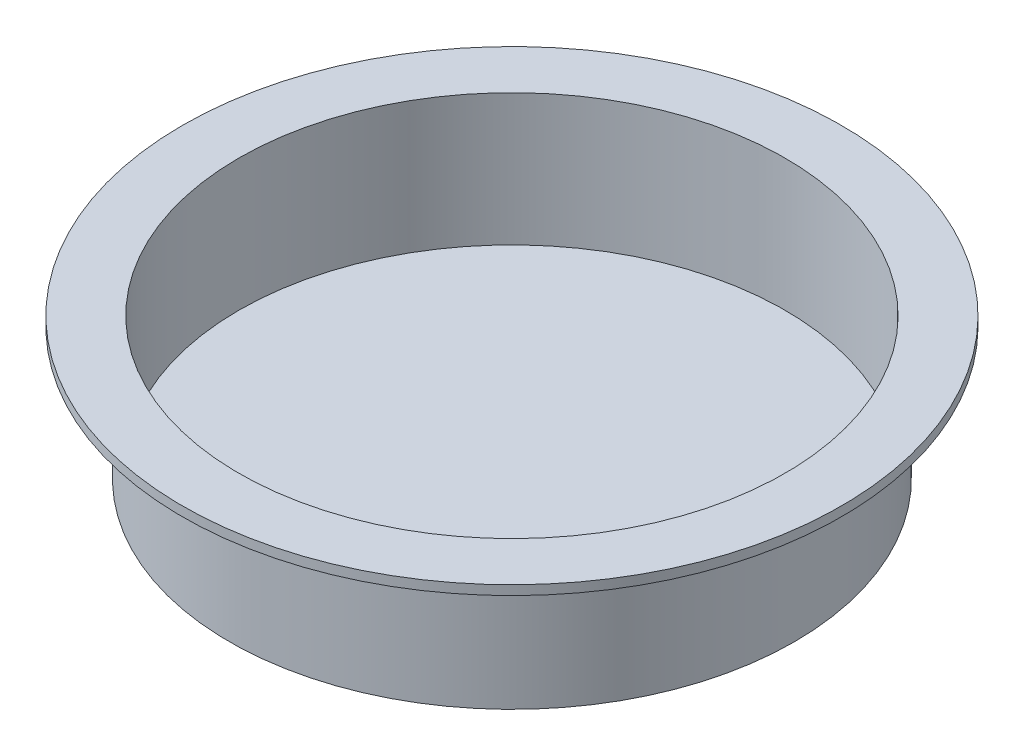
ISO-10303-21;
HEADER;
FILE_DESCRIPTION(('STEP AP214'),'2;1');
FILE_NAME('part.step','',(''),(''),'','','');
FILE_SCHEMA(('AUTOMOTIVE_DESIGN { 1 0 10303 214 1 1 1 1 }'));
ENDSEC;
DATA;
#1=APPLICATION_CONTEXT('core data for automotive mechanical design processes');
#2=APPLICATION_PROTOCOL_DEFINITION('international standard','automotive_design',2000,#1);
#3=PRODUCT_CONTEXT('',#1,'mechanical');
#4=PRODUCT('Part','Part','',(#3));
#5=PRODUCT_RELATED_PRODUCT_CATEGORY('part','',(#4));
#6=PRODUCT_DEFINITION_FORMATION('','',#4);
#7=PRODUCT_DEFINITION_CONTEXT('part definition',#1,'design');
#8=PRODUCT_DEFINITION('design','',#6,#7);
#9=PRODUCT_DEFINITION_SHAPE('','',#8);
#10=(LENGTH_UNIT() NAMED_UNIT(*) SI_UNIT(.MILLI.,.METRE.));
#11=(NAMED_UNIT(*) PLANE_ANGLE_UNIT() SI_UNIT($,.RADIAN.));
#12=(NAMED_UNIT(*) SI_UNIT($,.STERADIAN.) SOLID_ANGLE_UNIT());
#13=UNCERTAINTY_MEASURE_WITH_UNIT(LENGTH_MEASURE(1.E-05),#10,'distance_accuracy_value','');
#14=(GEOMETRIC_REPRESENTATION_CONTEXT(3) GLOBAL_UNCERTAINTY_ASSIGNED_CONTEXT((#13)) GLOBAL_UNIT_ASSIGNED_CONTEXT((#10,
#11,#12)) REPRESENTATION_CONTEXT('',''));
#15=CARTESIAN_POINT('',(0.,0.,0.));
#16=DIRECTION('',(0.,0.,1.));
#17=DIRECTION('',(1.,0.,0.));
#18=AXIS2_PLACEMENT_3D('',#15,#16,#17);
#19=CARTESIAN_POINT('',(0.,0.,0.));
#20=DIRECTION('',(0.,1.,0.));
#21=DIRECTION('',(-1.,0.,0.));
#22=AXIS2_PLACEMENT_3D('',#19,#20,#21);
#23=PLANE('',#22);
#24=CARTESIAN_POINT('',(0.,0.,0.));
#25=DIRECTION('',(0.,1.,0.));
#26=DIRECTION('',(-1.,0.,0.));
#27=AXIS2_PLACEMENT_3D('',#24,#25,#26);
#28=CIRCLE('',#27,38.1);
#29=CARTESIAN_POINT('',(-38.1,0.,0.));
#30=VERTEX_POINT('',#29);
#31=EDGE_CURVE('E10',#30,#30,#28,.T.);
#32=ORIENTED_EDGE('',*,*,#31,.F.);
#33=EDGE_LOOP('',(#32));
#34=FACE_BOUND('',#33,.T.);
#35=ADVANCED_FACE('F31',(#34),#23,.F.);
#36=CARTESIAN_POINT('',(0.,19.05,0.));
#37=DIRECTION('',(0.,1.,0.));
#38=DIRECTION('',(-1.,0.,0.));
#39=AXIS2_PLACEMENT_3D('',#36,#37,#38);
#40=CYLINDRICAL_SURFACE('',#39,38.1);
#41=CARTESIAN_POINT('',(0.,17.78,0.));
#42=DIRECTION('',(0.,1.,0.));
#43=DIRECTION('',(-1.,0.,0.));
#44=AXIS2_PLACEMENT_3D('',#41,#42,#43);
#45=CIRCLE('',#44,38.1);
#46=CARTESIAN_POINT('',(-38.1,17.78,0.));
#47=VERTEX_POINT('',#46);
#48=EDGE_CURVE('E37',#47,#47,#45,.T.);
#49=ORIENTED_EDGE('',*,*,#48,.F.);
#50=EDGE_LOOP('',(#49));
#51=FACE_BOUND('',#50,.T.);
#52=ORIENTED_EDGE('',*,*,#31,.T.);
#53=EDGE_LOOP('',(#52));
#54=FACE_BOUND('',#53,.T.);
#55=ADVANCED_FACE('F79',(#51,#54),#40,.T.);
#56=CARTESIAN_POINT('',(38.1,17.78,0.));
#57=DIRECTION('',(0.,1.,0.));
#58=DIRECTION('',(-1.,0.,0.));
#59=AXIS2_PLACEMENT_3D('',#56,#57,#58);
#60=PLANE('',#59);
#61=CARTESIAN_POINT('',(0.,17.78,0.));
#62=DIRECTION('',(0.,1.,0.));
#63=DIRECTION('',(-1.,0.,0.));
#64=AXIS2_PLACEMENT_3D('',#61,#62,#63);
#65=CIRCLE('',#64,44.45);
#66=CARTESIAN_POINT('',(-44.45,17.78,0.));
#67=VERTEX_POINT('',#66);
#68=EDGE_CURVE('E41',#67,#67,#65,.T.);
#69=ORIENTED_EDGE('',*,*,#68,.F.);
#70=EDGE_LOOP('',(#69));
#71=FACE_BOUND('',#70,.T.);
#72=ORIENTED_EDGE('',*,*,#48,.T.);
#73=EDGE_LOOP('',(#72));
#74=FACE_BOUND('',#73,.T.);
#75=ADVANCED_FACE('F74',(#71,#74),#60,.F.);
#76=CARTESIAN_POINT('',(0.,19.05,0.));
#77=DIRECTION('',(0.,1.,0.));
#78=DIRECTION('',(-1.,0.,0.));
#79=AXIS2_PLACEMENT_3D('',#76,#77,#78);
#80=CYLINDRICAL_SURFACE('',#79,44.45);
#81=CARTESIAN_POINT('',(0.,19.05,0.));
#82=DIRECTION('',(0.,1.,0.));
#83=DIRECTION('',(-1.,0.,0.));
#84=AXIS2_PLACEMENT_3D('',#81,#82,#83);
#85=CIRCLE('',#84,44.45);
#86=CARTESIAN_POINT('',(-44.45,19.05,0.));
#87=VERTEX_POINT('',#86);
#88=EDGE_CURVE('E45',#87,#87,#85,.T.);
#89=ORIENTED_EDGE('',*,*,#88,.F.);
#90=EDGE_LOOP('',(#89));
#91=FACE_BOUND('',#90,.T.);
#92=ORIENTED_EDGE('',*,*,#68,.T.);
#93=EDGE_LOOP('',(#92));
#94=FACE_BOUND('',#93,.T.);
#95=ADVANCED_FACE('F68',(#91,#94),#80,.T.);
#96=CARTESIAN_POINT('',(44.45,19.05,0.));
#97=DIRECTION('',(0.,-1.,0.));
#98=DIRECTION('',(1.,0.,0.));
#99=AXIS2_PLACEMENT_3D('',#96,#97,#98);
#100=PLANE('',#99);
#101=CARTESIAN_POINT('',(0.,19.05,0.));
#102=DIRECTION('',(0.,1.,0.));
#103=DIRECTION('',(-1.,0.,0.));
#104=AXIS2_PLACEMENT_3D('',#101,#102,#103);
#105=CIRCLE('',#104,36.83);
#106=CARTESIAN_POINT('',(-36.83,19.05,0.));
#107=VERTEX_POINT('',#106);
#108=EDGE_CURVE('E51',#107,#107,#105,.T.);
#109=ORIENTED_EDGE('',*,*,#108,.F.);
#110=EDGE_LOOP('',(#109));
#111=FACE_BOUND('',#110,.T.);
#112=ORIENTED_EDGE('',*,*,#88,.T.);
#113=EDGE_LOOP('',(#112));
#114=FACE_BOUND('',#113,.T.);
#115=ADVANCED_FACE('F62',(#111,#114),#100,.F.);
#116=CARTESIAN_POINT('',(0.,1.27,0.));
#117=DIRECTION('',(0.,1.,0.));
#118=DIRECTION('',(-1.,0.,0.));
#119=AXIS2_PLACEMENT_3D('',#116,#117,#118);
#120=CYLINDRICAL_SURFACE('',#119,36.83);
#121=CARTESIAN_POINT('',(0.,1.27,0.));
#122=DIRECTION('',(0.,1.,0.));
#123=DIRECTION('',(-1.,0.,0.));
#124=AXIS2_PLACEMENT_3D('',#121,#122,#123);
#125=CIRCLE('',#124,36.83);
#126=CARTESIAN_POINT('',(-36.83,1.27,0.));
#127=VERTEX_POINT('',#126);
#128=EDGE_CURVE('E50',#127,#127,#125,.T.);
#129=ORIENTED_EDGE('',*,*,#128,.F.);
#130=EDGE_LOOP('',(#129));
#131=FACE_BOUND('',#130,.T.);
#132=ORIENTED_EDGE('',*,*,#108,.T.);
#133=EDGE_LOOP('',(#132));
#134=FACE_BOUND('',#133,.T.);
#135=ADVANCED_FACE('F59',(#131,#134),#120,.F.);
#136=CARTESIAN_POINT('',(0.,1.27,0.));
#137=DIRECTION('',(0.,1.,0.));
#138=DIRECTION('',(-1.,0.,0.));
#139=AXIS2_PLACEMENT_3D('',#136,#137,#138);
#140=PLANE('',#139);
#141=ORIENTED_EDGE('',*,*,#128,.T.);
#142=EDGE_LOOP('',(#141));
#143=FACE_BOUND('',#142,.T.);
#144=ADVANCED_FACE('F57',(#143),#140,.T.);
#145=CLOSED_SHELL('',(#35,#55,#75,#95,#115,#135,#144));
#146=MANIFOLD_SOLID_BREP('B2',#145);
#147=ADVANCED_BREP_SHAPE_REPRESENTATION('',(#18,#146),#14);
#148=SHAPE_DEFINITION_REPRESENTATION(#9,#147);
ENDSEC;
END-ISO-10303-21;
